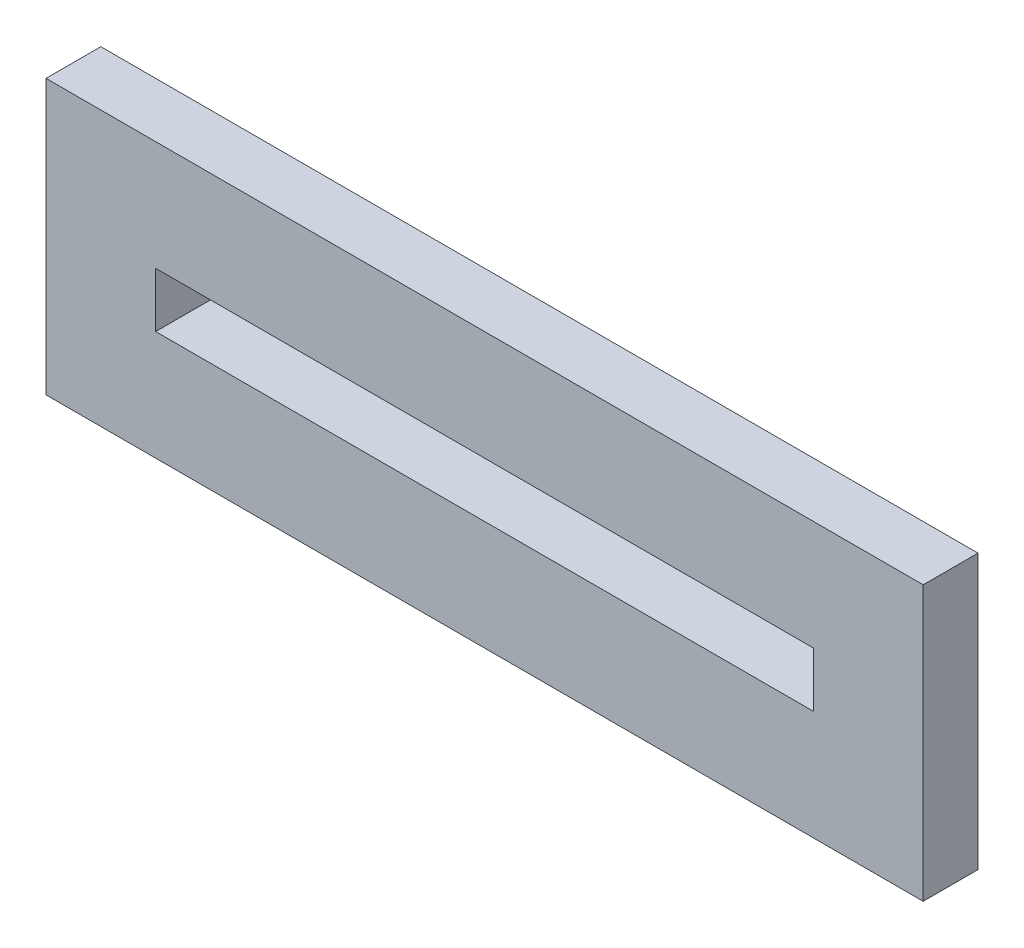
ISO-10303-21;
HEADER;
FILE_DESCRIPTION(('STEP AP214'),'2;1');
FILE_NAME('part.step','',(''),(''),'','','');
FILE_SCHEMA(('AUTOMOTIVE_DESIGN { 1 0 10303 214 1 1 1 1 }'));
ENDSEC;
DATA;
#1=APPLICATION_CONTEXT('core data for automotive mechanical design processes');
#2=APPLICATION_PROTOCOL_DEFINITION('international standard','automotive_design',2000,#1);
#3=PRODUCT_CONTEXT('',#1,'mechanical');
#4=PRODUCT('Part','Part','',(#3));
#5=PRODUCT_RELATED_PRODUCT_CATEGORY('part','',(#4));
#6=PRODUCT_DEFINITION_FORMATION('','',#4);
#7=PRODUCT_DEFINITION_CONTEXT('part definition',#1,'design');
#8=PRODUCT_DEFINITION('design','',#6,#7);
#9=PRODUCT_DEFINITION_SHAPE('','',#8);
#10=(LENGTH_UNIT() NAMED_UNIT(*) SI_UNIT(.MILLI.,.METRE.));
#11=(NAMED_UNIT(*) PLANE_ANGLE_UNIT() SI_UNIT($,.RADIAN.));
#12=(NAMED_UNIT(*) SI_UNIT($,.STERADIAN.) SOLID_ANGLE_UNIT());
#13=UNCERTAINTY_MEASURE_WITH_UNIT(LENGTH_MEASURE(1.E-05),#10,'distance_accuracy_value','');
#14=(GEOMETRIC_REPRESENTATION_CONTEXT(3) GLOBAL_UNCERTAINTY_ASSIGNED_CONTEXT((#13)) GLOBAL_UNIT_ASSIGNED_CONTEXT((#10,
#11,#12)) REPRESENTATION_CONTEXT('',''));
#15=CARTESIAN_POINT('',(0.,0.,0.));
#16=DIRECTION('',(0.,0.,1.));
#17=DIRECTION('',(1.,0.,0.));
#18=AXIS2_PLACEMENT_3D('',#15,#16,#17);
#19=CARTESIAN_POINT('',(0.,0.,3.175));
#20=DIRECTION('',(0.,0.,1.));
#21=DIRECTION('',(1.,0.,0.));
#22=AXIS2_PLACEMENT_3D('',#19,#20,#21);
#23=PLANE('',#22);
#24=DIRECTION('',(0.,-1.,0.));
#25=VECTOR('',#24,1.);
#26=CARTESIAN_POINT('',(-6.35,6.35,3.175));
#27=LINE('',#26,#25);
#28=CARTESIAN_POINT('',(-6.35,6.35,3.175));
#29=VERTEX_POINT('',#28);
#30=CARTESIAN_POINT('',(-6.35,-9.525,3.175));
#31=VERTEX_POINT('',#30);
#32=EDGE_CURVE('E134',#29,#31,#27,.T.);
#33=ORIENTED_EDGE('',*,*,#32,.T.);
#34=DIRECTION('',(1.,0.,0.));
#35=VECTOR('',#34,1.);
#36=CARTESIAN_POINT('',(-6.35,-9.525,3.175));
#37=LINE('',#36,#35);
#38=CARTESIAN_POINT('',(44.45,-9.525,3.175));
#39=VERTEX_POINT('',#38);
#40=EDGE_CURVE('E137',#31,#39,#37,.T.);
#41=ORIENTED_EDGE('',*,*,#40,.T.);
#42=DIRECTION('',(0.,1.,0.));
#43=VECTOR('',#42,1.);
#44=CARTESIAN_POINT('',(44.45,6.35,3.175));
#45=LINE('',#44,#43);
#46=CARTESIAN_POINT('',(44.45,6.35,3.175));
#47=VERTEX_POINT('',#46);
#48=EDGE_CURVE('E140',#39,#47,#45,.T.);
#49=ORIENTED_EDGE('',*,*,#48,.T.);
#50=DIRECTION('',(-1.,0.,0.));
#51=VECTOR('',#50,1.);
#52=CARTESIAN_POINT('',(-6.35,6.35,3.175));
#53=LINE('',#52,#51);
#54=EDGE_CURVE('E142',#47,#29,#53,.T.);
#55=ORIENTED_EDGE('',*,*,#54,.T.);
#56=EDGE_LOOP('',(#33,#41,#49,#55));
#57=FACE_BOUND('',#56,.T.);
#58=DIRECTION('',(1.,0.,0.));
#59=VECTOR('',#58,1.);
#60=CARTESIAN_POINT('',(0.,-3.175,3.175));
#61=LINE('',#60,#59);
#62=CARTESIAN_POINT('',(0.,-3.175,3.175));
#63=VERTEX_POINT('',#62);
#64=CARTESIAN_POINT('',(38.1,-3.175,3.175));
#65=VERTEX_POINT('',#64);
#66=EDGE_CURVE('E106',#63,#65,#61,.T.);
#67=ORIENTED_EDGE('',*,*,#66,.F.);
#68=DIRECTION('',(0.,-1.,0.));
#69=VECTOR('',#68,1.);
#70=CARTESIAN_POINT('',(0.,0.,3.175));
#71=LINE('',#70,#69);
#72=CARTESIAN_POINT('',(0.,0.,3.175));
#73=VERTEX_POINT('',#72);
#74=EDGE_CURVE('E98',#73,#63,#71,.T.);
#75=ORIENTED_EDGE('',*,*,#74,.F.);
#76=DIRECTION('',(-1.,0.,0.));
#77=VECTOR('',#76,1.);
#78=CARTESIAN_POINT('',(0.,0.,3.175));
#79=LINE('',#78,#77);
#80=CARTESIAN_POINT('',(38.1,0.,3.175));
#81=VERTEX_POINT('',#80);
#82=EDGE_CURVE('E120',#81,#73,#79,.T.);
#83=ORIENTED_EDGE('',*,*,#82,.F.);
#84=DIRECTION('',(0.,1.,0.));
#85=VECTOR('',#84,1.);
#86=CARTESIAN_POINT('',(38.1,0.,3.175));
#87=LINE('',#86,#85);
#88=EDGE_CURVE('E118',#65,#81,#87,.T.);
#89=ORIENTED_EDGE('',*,*,#88,.F.);
#90=EDGE_LOOP('',(#67,#75,#83,#89));
#91=FACE_BOUND('',#90,.T.);
#92=ADVANCED_FACE('F33',(#57,#91),#23,.T.);
#93=CARTESIAN_POINT('',(0.,0.,0.));
#94=DIRECTION('',(0.,0.,1.));
#95=DIRECTION('',(1.,0.,0.));
#96=AXIS2_PLACEMENT_3D('',#93,#94,#95);
#97=PLANE('',#96);
#98=DIRECTION('',(0.,-1.,0.));
#99=VECTOR('',#98,1.);
#100=CARTESIAN_POINT('',(-6.35,6.35,0.));
#101=LINE('',#100,#99);
#102=CARTESIAN_POINT('',(-6.35,6.35,0.));
#103=VERTEX_POINT('',#102);
#104=CARTESIAN_POINT('',(-6.35,-9.525,0.));
#105=VERTEX_POINT('',#104);
#106=EDGE_CURVE('E114',#103,#105,#101,.T.);
#107=ORIENTED_EDGE('',*,*,#106,.F.);
#108=DIRECTION('',(-1.,0.,0.));
#109=VECTOR('',#108,1.);
#110=CARTESIAN_POINT('',(-6.35,6.35,0.));
#111=LINE('',#110,#109);
#112=CARTESIAN_POINT('',(44.45,6.35,0.));
#113=VERTEX_POINT('',#112);
#114=EDGE_CURVE('E138',#113,#103,#111,.T.);
#115=ORIENTED_EDGE('',*,*,#114,.F.);
#116=DIRECTION('',(0.,1.,0.));
#117=VECTOR('',#116,1.);
#118=CARTESIAN_POINT('',(44.45,6.35,0.));
#119=LINE('',#118,#117);
#120=CARTESIAN_POINT('',(44.45,-9.525,0.));
#121=VERTEX_POINT('',#120);
#122=EDGE_CURVE('E149',#121,#113,#119,.T.);
#123=ORIENTED_EDGE('',*,*,#122,.F.);
#124=DIRECTION('',(1.,0.,0.));
#125=VECTOR('',#124,1.);
#126=CARTESIAN_POINT('',(-6.35,-9.525,0.));
#127=LINE('',#126,#125);
#128=EDGE_CURVE('E147',#105,#121,#127,.T.);
#129=ORIENTED_EDGE('',*,*,#128,.F.);
#130=EDGE_LOOP('',(#107,#115,#123,#129));
#131=FACE_BOUND('',#130,.T.);
#132=DIRECTION('',(0.,-1.,0.));
#133=VECTOR('',#132,1.);
#134=CARTESIAN_POINT('',(0.,0.,0.));
#135=LINE('',#134,#133);
#136=CARTESIAN_POINT('',(0.,0.,0.));
#137=VERTEX_POINT('',#136);
#138=CARTESIAN_POINT('',(0.,-3.175,0.));
#139=VERTEX_POINT('',#138);
#140=EDGE_CURVE('E56',#137,#139,#135,.T.);
#141=ORIENTED_EDGE('',*,*,#140,.T.);
#142=DIRECTION('',(1.,0.,0.));
#143=VECTOR('',#142,1.);
#144=CARTESIAN_POINT('',(0.,-3.175,0.));
#145=LINE('',#144,#143);
#146=CARTESIAN_POINT('',(38.1,-3.175,0.));
#147=VERTEX_POINT('',#146);
#148=EDGE_CURVE('E113',#139,#147,#145,.T.);
#149=ORIENTED_EDGE('',*,*,#148,.T.);
#150=DIRECTION('',(0.,1.,0.));
#151=VECTOR('',#150,1.);
#152=CARTESIAN_POINT('',(38.1,0.,0.));
#153=LINE('',#152,#151);
#154=CARTESIAN_POINT('',(38.1,0.,0.));
#155=VERTEX_POINT('',#154);
#156=EDGE_CURVE('E126',#147,#155,#153,.T.);
#157=ORIENTED_EDGE('',*,*,#156,.T.);
#158=DIRECTION('',(-1.,0.,0.));
#159=VECTOR('',#158,1.);
#160=CARTESIAN_POINT('',(0.,0.,0.));
#161=LINE('',#160,#159);
#162=EDGE_CURVE('E107',#155,#137,#161,.T.);
#163=ORIENTED_EDGE('',*,*,#162,.T.);
#164=EDGE_LOOP('',(#141,#149,#157,#163));
#165=FACE_BOUND('',#164,.T.);
#166=ADVANCED_FACE('F167',(#131,#165),#97,.F.);
#167=CARTESIAN_POINT('',(-6.35,6.35,3.175));
#168=DIRECTION('',(1.,0.,0.));
#169=DIRECTION('',(0.,0.,-1.));
#170=AXIS2_PLACEMENT_3D('',#167,#168,#169);
#171=PLANE('',#170);
#172=ORIENTED_EDGE('',*,*,#106,.T.);
#173=DIRECTION('',(0.,0.,-1.));
#174=VECTOR('',#173,1.);
#175=CARTESIAN_POINT('',(-6.35,-9.525,3.175));
#176=LINE('',#175,#174);
#177=EDGE_CURVE('E11',#31,#105,#176,.T.);
#178=ORIENTED_EDGE('',*,*,#177,.F.);
#179=ORIENTED_EDGE('',*,*,#32,.F.);
#180=DIRECTION('',(0.,0.,-1.));
#181=VECTOR('',#180,1.);
#182=CARTESIAN_POINT('',(-6.35,6.35,3.175));
#183=LINE('',#182,#181);
#184=EDGE_CURVE('E144',#29,#103,#183,.T.);
#185=ORIENTED_EDGE('',*,*,#184,.T.);
#186=EDGE_LOOP('',(#172,#178,#179,#185));
#187=FACE_BOUND('',#186,.T.);
#188=ADVANCED_FACE('F35',(#187),#171,.F.);
#189=CARTESIAN_POINT('',(-6.35,-9.525,3.175));
#190=DIRECTION('',(0.,1.,0.));
#191=DIRECTION('',(0.,0.,1.));
#192=AXIS2_PLACEMENT_3D('',#189,#190,#191);
#193=PLANE('',#192);
#194=ORIENTED_EDGE('',*,*,#128,.T.);
#195=DIRECTION('',(0.,0.,-1.));
#196=VECTOR('',#195,1.);
#197=CARTESIAN_POINT('',(44.45,-9.525,3.175));
#198=LINE('',#197,#196);
#199=EDGE_CURVE('E41',#39,#121,#198,.T.);
#200=ORIENTED_EDGE('',*,*,#199,.F.);
#201=ORIENTED_EDGE('',*,*,#40,.F.);
#202=ORIENTED_EDGE('',*,*,#177,.T.);
#203=EDGE_LOOP('',(#194,#200,#201,#202));
#204=FACE_BOUND('',#203,.T.);
#205=ADVANCED_FACE('F177',(#204),#193,.F.);
#206=CARTESIAN_POINT('',(44.45,6.35,3.175));
#207=DIRECTION('',(-1.,0.,0.));
#208=DIRECTION('',(0.,0.,1.));
#209=AXIS2_PLACEMENT_3D('',#206,#207,#208);
#210=PLANE('',#209);
#211=ORIENTED_EDGE('',*,*,#122,.T.);
#212=DIRECTION('',(0.,0.,-1.));
#213=VECTOR('',#212,1.);
#214=CARTESIAN_POINT('',(44.45,6.35,3.175));
#215=LINE('',#214,#213);
#216=EDGE_CURVE('E154',#47,#113,#215,.T.);
#217=ORIENTED_EDGE('',*,*,#216,.F.);
#218=ORIENTED_EDGE('',*,*,#48,.F.);
#219=ORIENTED_EDGE('',*,*,#199,.T.);
#220=EDGE_LOOP('',(#211,#217,#218,#219));
#221=FACE_BOUND('',#220,.T.);
#222=ADVANCED_FACE('F161',(#221),#210,.F.);
#223=CARTESIAN_POINT('',(-6.35,6.35,3.175));
#224=DIRECTION('',(0.,-1.,0.));
#225=DIRECTION('',(0.,0.,-1.));
#226=AXIS2_PLACEMENT_3D('',#223,#224,#225);
#227=PLANE('',#226);
#228=ORIENTED_EDGE('',*,*,#114,.T.);
#229=ORIENTED_EDGE('',*,*,#184,.F.);
#230=ORIENTED_EDGE('',*,*,#54,.F.);
#231=ORIENTED_EDGE('',*,*,#216,.T.);
#232=EDGE_LOOP('',(#228,#229,#230,#231));
#233=FACE_BOUND('',#232,.T.);
#234=ADVANCED_FACE('F171',(#233),#227,.F.);
#235=CARTESIAN_POINT('',(0.,0.,3.175));
#236=DIRECTION('',(1.,0.,0.));
#237=DIRECTION('',(0.,1.,0.));
#238=AXIS2_PLACEMENT_3D('',#235,#236,#237);
#239=PLANE('',#238);
#240=ORIENTED_EDGE('',*,*,#140,.F.);
#241=DIRECTION('',(0.,0.,-1.));
#242=VECTOR('',#241,1.);
#243=CARTESIAN_POINT('',(0.,0.,3.175));
#244=LINE('',#243,#242);
#245=EDGE_CURVE('E102',#73,#137,#244,.T.);
#246=ORIENTED_EDGE('',*,*,#245,.F.);
#247=ORIENTED_EDGE('',*,*,#74,.T.);
#248=DIRECTION('',(0.,0.,-1.));
#249=VECTOR('',#248,1.);
#250=CARTESIAN_POINT('',(0.,-3.175,3.175));
#251=LINE('',#250,#249);
#252=EDGE_CURVE('E101',#63,#139,#251,.T.);
#253=ORIENTED_EDGE('',*,*,#252,.T.);
#254=EDGE_LOOP('',(#240,#246,#247,#253));
#255=FACE_BOUND('',#254,.T.);
#256=ADVANCED_FACE('F100',(#255),#239,.T.);
#257=CARTESIAN_POINT('',(0.,-3.175,3.175));
#258=DIRECTION('',(0.,1.,0.));
#259=DIRECTION('',(0.,0.,1.));
#260=AXIS2_PLACEMENT_3D('',#257,#258,#259);
#261=PLANE('',#260);
#262=ORIENTED_EDGE('',*,*,#148,.F.);
#263=ORIENTED_EDGE('',*,*,#252,.F.);
#264=ORIENTED_EDGE('',*,*,#66,.T.);
#265=DIRECTION('',(0.,0.,-1.));
#266=VECTOR('',#265,1.);
#267=CARTESIAN_POINT('',(38.1,-3.175,3.175));
#268=LINE('',#267,#266);
#269=EDGE_CURVE('E115',#65,#147,#268,.T.);
#270=ORIENTED_EDGE('',*,*,#269,.T.);
#271=EDGE_LOOP('',(#262,#263,#264,#270));
#272=FACE_BOUND('',#271,.T.);
#273=ADVANCED_FACE('F110',(#272),#261,.T.);
#274=CARTESIAN_POINT('',(38.1,0.,3.175));
#275=DIRECTION('',(-1.,0.,0.));
#276=DIRECTION('',(0.,0.,1.));
#277=AXIS2_PLACEMENT_3D('',#274,#275,#276);
#278=PLANE('',#277);
#279=ORIENTED_EDGE('',*,*,#156,.F.);
#280=ORIENTED_EDGE('',*,*,#269,.F.);
#281=ORIENTED_EDGE('',*,*,#88,.T.);
#282=DIRECTION('',(0.,0.,-1.));
#283=VECTOR('',#282,1.);
#284=CARTESIAN_POINT('',(38.1,0.,3.175));
#285=LINE('',#284,#283);
#286=EDGE_CURVE('E48',#81,#155,#285,.T.);
#287=ORIENTED_EDGE('',*,*,#286,.T.);
#288=EDGE_LOOP('',(#279,#280,#281,#287));
#289=FACE_BOUND('',#288,.T.);
#290=ADVANCED_FACE('F200',(#289),#278,.T.);
#291=CARTESIAN_POINT('',(0.,0.,3.175));
#292=DIRECTION('',(0.,-1.,0.));
#293=DIRECTION('',(0.,0.,-1.));
#294=AXIS2_PLACEMENT_3D('',#291,#292,#293);
#295=PLANE('',#294);
#296=ORIENTED_EDGE('',*,*,#162,.F.);
#297=ORIENTED_EDGE('',*,*,#286,.F.);
#298=ORIENTED_EDGE('',*,*,#82,.T.);
#299=ORIENTED_EDGE('',*,*,#245,.T.);
#300=EDGE_LOOP('',(#296,#297,#298,#299));
#301=FACE_BOUND('',#300,.T.);
#302=ADVANCED_FACE('F204',(#301),#295,.T.);
#303=CLOSED_SHELL('',(#92,#166,#188,#205,#222,#234,#256,#273,#290,#302));
#304=MANIFOLD_SOLID_BREP('B2',#303);
#305=ADVANCED_BREP_SHAPE_REPRESENTATION('',(#18,#304),#14);
#306=SHAPE_DEFINITION_REPRESENTATION(#9,#305);
ENDSEC;
END-ISO-10303-21;
